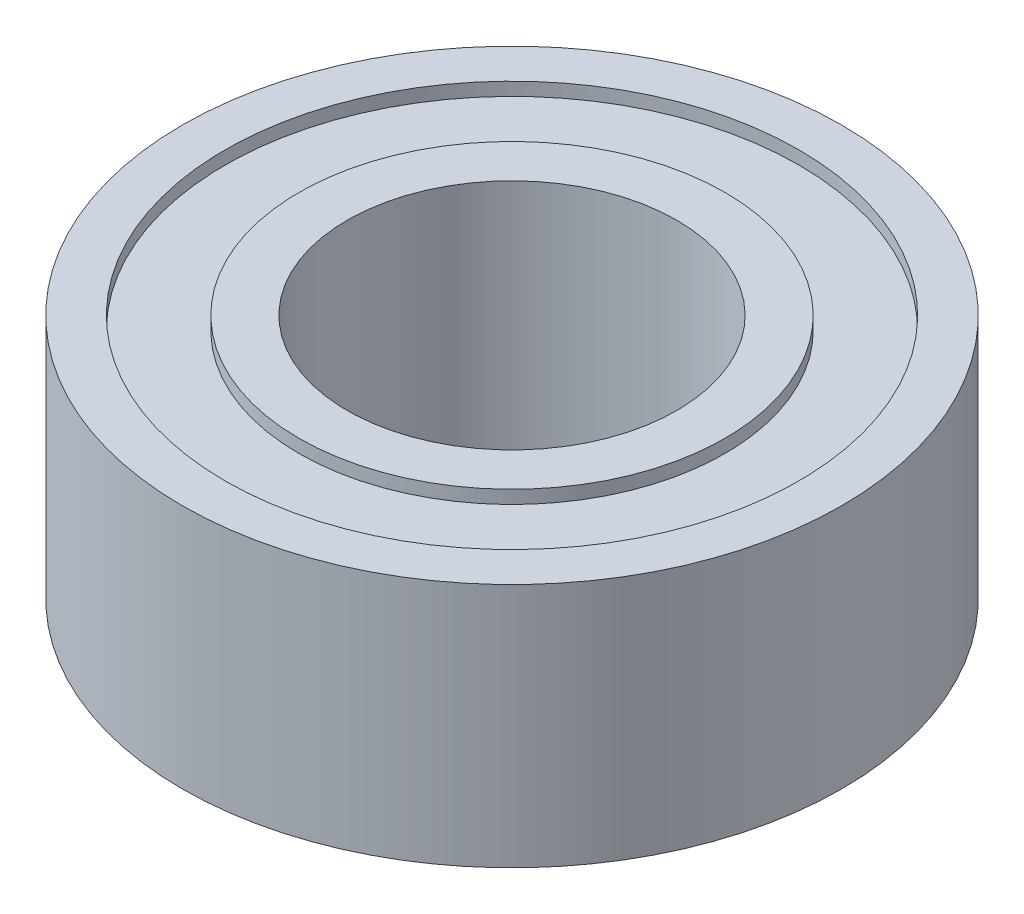
ISO-10303-21;
HEADER;
FILE_DESCRIPTION(('STEP AP214'),'2;1');
FILE_NAME('part.step','',(''),(''),'','','');
FILE_SCHEMA(('AUTOMOTIVE_DESIGN { 1 0 10303 214 1 1 1 1 }'));
ENDSEC;
DATA;
#1=APPLICATION_CONTEXT('core data for automotive mechanical design processes');
#2=APPLICATION_PROTOCOL_DEFINITION('international standard','automotive_design',2000,#1);
#3=PRODUCT_CONTEXT('',#1,'mechanical');
#4=PRODUCT('Part','Part','',(#3));
#5=PRODUCT_RELATED_PRODUCT_CATEGORY('part','',(#4));
#6=PRODUCT_DEFINITION_FORMATION('','',#4);
#7=PRODUCT_DEFINITION_CONTEXT('part definition',#1,'design');
#8=PRODUCT_DEFINITION('design','',#6,#7);
#9=PRODUCT_DEFINITION_SHAPE('','',#8);
#10=(LENGTH_UNIT() NAMED_UNIT(*) SI_UNIT(.MILLI.,.METRE.));
#11=(NAMED_UNIT(*) PLANE_ANGLE_UNIT() SI_UNIT($,.RADIAN.));
#12=(NAMED_UNIT(*) SI_UNIT($,.STERADIAN.) SOLID_ANGLE_UNIT());
#13=UNCERTAINTY_MEASURE_WITH_UNIT(LENGTH_MEASURE(1.E-05),#10,'distance_accuracy_value','');
#14=(GEOMETRIC_REPRESENTATION_CONTEXT(3) GLOBAL_UNCERTAINTY_ASSIGNED_CONTEXT((#13)) GLOBAL_UNIT_ASSIGNED_CONTEXT((#10,
#11,#12)) REPRESENTATION_CONTEXT('',''));
#15=CARTESIAN_POINT('',(0.,0.,0.));
#16=DIRECTION('',(0.,0.,1.));
#17=DIRECTION('',(1.,0.,0.));
#18=AXIS2_PLACEMENT_3D('',#15,#16,#17);
#19=CARTESIAN_POINT('',(0.,4.7244,0.));
#20=DIRECTION('',(0.,-1.,0.));
#21=DIRECTION('',(0.,0.,-1.));
#22=AXIS2_PLACEMENT_3D('',#19,#20,#21);
#23=CYLINDRICAL_SURFACE('',#22,4.1021);
#24=CARTESIAN_POINT('',(0.,4.7244,0.));
#25=DIRECTION('',(0.,-1.,0.));
#26=DIRECTION('',(0.,0.,-1.));
#27=AXIS2_PLACEMENT_3D('',#24,#25,#26);
#28=CIRCLE('',#27,4.1021);
#29=CARTESIAN_POINT('',(0.,4.7244,-4.1021));
#30=VERTEX_POINT('',#29);
#31=EDGE_CURVE('E10',#30,#30,#28,.T.);
#32=ORIENTED_EDGE('',*,*,#31,.T.);
#33=EDGE_LOOP('',(#32));
#34=FACE_BOUND('',#33,.T.);
#35=CARTESIAN_POINT('',(0.,4.4704,0.));
#36=DIRECTION('',(0.,-1.,0.));
#37=DIRECTION('',(0.,0.,-1.));
#38=AXIS2_PLACEMENT_3D('',#35,#36,#37);
#39=CIRCLE('',#38,4.1021);
#40=CARTESIAN_POINT('',(0.,4.4704,-4.1021));
#41=VERTEX_POINT('',#40);
#42=EDGE_CURVE('E71',#41,#41,#39,.T.);
#43=ORIENTED_EDGE('',*,*,#42,.F.);
#44=EDGE_LOOP('',(#43));
#45=FACE_BOUND('',#44,.T.);
#46=ADVANCED_FACE('F31',(#34,#45),#23,.T.);
#47=CARTESIAN_POINT('',(4.1021,4.7244,0.));
#48=DIRECTION('',(0.,1.,0.));
#49=DIRECTION('',(0.,0.,1.));
#50=AXIS2_PLACEMENT_3D('',#47,#48,#49);
#51=PLANE('',#50);
#52=CARTESIAN_POINT('',(0.,4.7244,0.));
#53=DIRECTION('',(0.,-1.,0.));
#54=DIRECTION('',(0.,0.,-1.));
#55=AXIS2_PLACEMENT_3D('',#52,#53,#54);
#56=CIRCLE('',#55,3.175);
#57=CARTESIAN_POINT('',(0.,4.7244,-3.175));
#58=VERTEX_POINT('',#57);
#59=EDGE_CURVE('E37',#58,#58,#56,.T.);
#60=ORIENTED_EDGE('',*,*,#59,.T.);
#61=EDGE_LOOP('',(#60));
#62=FACE_BOUND('',#61,.T.);
#63=ORIENTED_EDGE('',*,*,#31,.F.);
#64=EDGE_LOOP('',(#63));
#65=FACE_BOUND('',#64,.T.);
#66=ADVANCED_FACE('F79',(#62,#65),#51,.T.);
#67=CARTESIAN_POINT('',(0.,4.7244,0.));
#68=DIRECTION('',(0.,-1.,0.));
#69=DIRECTION('',(0.,0.,-1.));
#70=AXIS2_PLACEMENT_3D('',#67,#68,#69);
#71=CYLINDRICAL_SURFACE('',#70,3.175);
#72=CARTESIAN_POINT('',(0.,0.,0.));
#73=DIRECTION('',(0.,-1.,0.));
#74=DIRECTION('',(0.,0.,-1.));
#75=AXIS2_PLACEMENT_3D('',#72,#73,#74);
#76=CIRCLE('',#75,3.175);
#77=CARTESIAN_POINT('',(0.,0.,-3.175));
#78=VERTEX_POINT('',#77);
#79=EDGE_CURVE('E41',#78,#78,#76,.T.);
#80=ORIENTED_EDGE('',*,*,#79,.T.);
#81=EDGE_LOOP('',(#80));
#82=FACE_BOUND('',#81,.T.);
#83=ORIENTED_EDGE('',*,*,#59,.F.);
#84=EDGE_LOOP('',(#83));
#85=FACE_BOUND('',#84,.T.);
#86=ADVANCED_FACE('F83',(#82,#85),#71,.F.);
#87=CARTESIAN_POINT('',(3.175,0.,0.));
#88=DIRECTION('',(0.,-1.,0.));
#89=DIRECTION('',(0.,0.,-1.));
#90=AXIS2_PLACEMENT_3D('',#87,#88,#89);
#91=PLANE('',#90);
#92=CARTESIAN_POINT('',(0.,0.,0.));
#93=DIRECTION('',(0.,-1.,0.));
#94=DIRECTION('',(0.,0.,-1.));
#95=AXIS2_PLACEMENT_3D('',#92,#93,#94);
#96=CIRCLE('',#95,4.1021);
#97=CARTESIAN_POINT('',(0.,0.,-4.1021));
#98=VERTEX_POINT('',#97);
#99=EDGE_CURVE('E45',#98,#98,#96,.T.);
#100=ORIENTED_EDGE('',*,*,#99,.T.);
#101=EDGE_LOOP('',(#100));
#102=FACE_BOUND('',#101,.T.);
#103=ORIENTED_EDGE('',*,*,#79,.F.);
#104=EDGE_LOOP('',(#103));
#105=FACE_BOUND('',#104,.T.);
#106=ADVANCED_FACE('F87',(#102,#105),#91,.T.);
#107=CARTESIAN_POINT('',(0.,4.7244,0.));
#108=DIRECTION('',(0.,-1.,0.));
#109=DIRECTION('',(0.,0.,-1.));
#110=AXIS2_PLACEMENT_3D('',#107,#108,#109);
#111=CYLINDRICAL_SURFACE('',#110,4.1021);
#112=CARTESIAN_POINT('',(0.,0.254,0.));
#113=DIRECTION('',(0.,-1.,0.));
#114=DIRECTION('',(0.,0.,-1.));
#115=AXIS2_PLACEMENT_3D('',#112,#113,#114);
#116=CIRCLE('',#115,4.1021);
#117=CARTESIAN_POINT('',(0.,0.254,-4.1021));
#118=VERTEX_POINT('',#117);
#119=EDGE_CURVE('E50',#118,#118,#116,.T.);
#120=ORIENTED_EDGE('',*,*,#119,.T.);
#121=EDGE_LOOP('',(#120));
#122=FACE_BOUND('',#121,.T.);
#123=ORIENTED_EDGE('',*,*,#99,.F.);
#124=EDGE_LOOP('',(#123));
#125=FACE_BOUND('',#124,.T.);
#126=ADVANCED_FACE('F94',(#122,#125),#111,.T.);
#127=CARTESIAN_POINT('',(4.1021,0.254,0.));
#128=DIRECTION('',(0.,-1.,0.));
#129=DIRECTION('',(0.,0.,-1.));
#130=AXIS2_PLACEMENT_3D('',#127,#128,#129);
#131=PLANE('',#130);
#132=CARTESIAN_POINT('',(0.,0.254,0.));
#133=DIRECTION('',(0.,-1.,0.));
#134=DIRECTION('',(0.,0.,-1.));
#135=AXIS2_PLACEMENT_3D('',#132,#133,#134);
#136=CIRCLE('',#135,5.5245);
#137=CARTESIAN_POINT('',(0.,0.254,-5.5245));
#138=VERTEX_POINT('',#137);
#139=EDGE_CURVE('E53',#138,#138,#136,.T.);
#140=ORIENTED_EDGE('',*,*,#139,.T.);
#141=EDGE_LOOP('',(#140));
#142=FACE_BOUND('',#141,.T.);
#143=ORIENTED_EDGE('',*,*,#119,.F.);
#144=EDGE_LOOP('',(#143));
#145=FACE_BOUND('',#144,.T.);
#146=ADVANCED_FACE('F98',(#142,#145),#131,.T.);
#147=CARTESIAN_POINT('',(0.,4.7244,0.));
#148=DIRECTION('',(0.,-1.,0.));
#149=DIRECTION('',(0.,0.,-1.));
#150=AXIS2_PLACEMENT_3D('',#147,#148,#149);
#151=CYLINDRICAL_SURFACE('',#150,5.5245);
#152=CARTESIAN_POINT('',(0.,0.,0.));
#153=DIRECTION('',(0.,-1.,0.));
#154=DIRECTION('',(0.,0.,-1.));
#155=AXIS2_PLACEMENT_3D('',#152,#153,#154);
#156=CIRCLE('',#155,5.5245);
#157=CARTESIAN_POINT('',(0.,0.,-5.5245));
#158=VERTEX_POINT('',#157);
#159=EDGE_CURVE('E56',#158,#158,#156,.T.);
#160=ORIENTED_EDGE('',*,*,#159,.T.);
#161=EDGE_LOOP('',(#160));
#162=FACE_BOUND('',#161,.T.);
#163=ORIENTED_EDGE('',*,*,#139,.F.);
#164=EDGE_LOOP('',(#163));
#165=FACE_BOUND('',#164,.T.);
#166=ADVANCED_FACE('F102',(#162,#165),#151,.F.);
#167=CARTESIAN_POINT('',(5.5245,0.,0.));
#168=DIRECTION('',(0.,-1.,0.));
#169=DIRECTION('',(0.,0.,-1.));
#170=AXIS2_PLACEMENT_3D('',#167,#168,#169);
#171=PLANE('',#170);
#172=CARTESIAN_POINT('',(0.,0.,0.));
#173=DIRECTION('',(0.,-1.,0.));
#174=DIRECTION('',(0.,0.,-1.));
#175=AXIS2_PLACEMENT_3D('',#172,#173,#174);
#176=CIRCLE('',#175,6.35);
#177=CARTESIAN_POINT('',(0.,0.,-6.35));
#178=VERTEX_POINT('',#177);
#179=EDGE_CURVE('E59',#178,#178,#176,.T.);
#180=ORIENTED_EDGE('',*,*,#179,.T.);
#181=EDGE_LOOP('',(#180));
#182=FACE_BOUND('',#181,.T.);
#183=ORIENTED_EDGE('',*,*,#159,.F.);
#184=EDGE_LOOP('',(#183));
#185=FACE_BOUND('',#184,.T.);
#186=ADVANCED_FACE('F106',(#182,#185),#171,.T.);
#187=CARTESIAN_POINT('',(0.,4.7244,0.));
#188=DIRECTION('',(0.,-1.,0.));
#189=DIRECTION('',(0.,0.,-1.));
#190=AXIS2_PLACEMENT_3D('',#187,#188,#189);
#191=CYLINDRICAL_SURFACE('',#190,6.35);
#192=CARTESIAN_POINT('',(0.,4.7244,0.));
#193=DIRECTION('',(0.,-1.,0.));
#194=DIRECTION('',(0.,0.,-1.));
#195=AXIS2_PLACEMENT_3D('',#192,#193,#194);
#196=CIRCLE('',#195,6.35);
#197=CARTESIAN_POINT('',(0.,4.7244,-6.35));
#198=VERTEX_POINT('',#197);
#199=EDGE_CURVE('E62',#198,#198,#196,.T.);
#200=ORIENTED_EDGE('',*,*,#199,.T.);
#201=EDGE_LOOP('',(#200));
#202=FACE_BOUND('',#201,.T.);
#203=ORIENTED_EDGE('',*,*,#179,.F.);
#204=EDGE_LOOP('',(#203));
#205=FACE_BOUND('',#204,.T.);
#206=ADVANCED_FACE('F110',(#202,#205),#191,.T.);
#207=CARTESIAN_POINT('',(6.35,4.7244,0.));
#208=DIRECTION('',(0.,1.,0.));
#209=DIRECTION('',(0.,0.,1.));
#210=AXIS2_PLACEMENT_3D('',#207,#208,#209);
#211=PLANE('',#210);
#212=CARTESIAN_POINT('',(0.,4.7244,0.));
#213=DIRECTION('',(0.,-1.,0.));
#214=DIRECTION('',(0.,0.,-1.));
#215=AXIS2_PLACEMENT_3D('',#212,#213,#214);
#216=CIRCLE('',#215,5.5245);
#217=CARTESIAN_POINT('',(0.,4.7244,-5.5245));
#218=VERTEX_POINT('',#217);
#219=EDGE_CURVE('E65',#218,#218,#216,.T.);
#220=ORIENTED_EDGE('',*,*,#219,.T.);
#221=EDGE_LOOP('',(#220));
#222=FACE_BOUND('',#221,.T.);
#223=ORIENTED_EDGE('',*,*,#199,.F.);
#224=EDGE_LOOP('',(#223));
#225=FACE_BOUND('',#224,.T.);
#226=ADVANCED_FACE('F114',(#222,#225),#211,.T.);
#227=CARTESIAN_POINT('',(0.,4.7244,0.));
#228=DIRECTION('',(0.,-1.,0.));
#229=DIRECTION('',(0.,0.,-1.));
#230=AXIS2_PLACEMENT_3D('',#227,#228,#229);
#231=CYLINDRICAL_SURFACE('',#230,5.5245);
#232=CARTESIAN_POINT('',(0.,4.4704,0.));
#233=DIRECTION('',(0.,-1.,0.));
#234=DIRECTION('',(0.,0.,-1.));
#235=AXIS2_PLACEMENT_3D('',#232,#233,#234);
#236=CIRCLE('',#235,5.5245);
#237=CARTESIAN_POINT('',(0.,4.4704,-5.5245));
#238=VERTEX_POINT('',#237);
#239=EDGE_CURVE('E68',#238,#238,#236,.T.);
#240=ORIENTED_EDGE('',*,*,#239,.T.);
#241=EDGE_LOOP('',(#240));
#242=FACE_BOUND('',#241,.T.);
#243=ORIENTED_EDGE('',*,*,#219,.F.);
#244=EDGE_LOOP('',(#243));
#245=FACE_BOUND('',#244,.T.);
#246=ADVANCED_FACE('F118',(#242,#245),#231,.F.);
#247=CARTESIAN_POINT('',(5.5245,4.4704,0.));
#248=DIRECTION('',(0.,1.,0.));
#249=DIRECTION('',(0.,0.,1.));
#250=AXIS2_PLACEMENT_3D('',#247,#248,#249);
#251=PLANE('',#250);
#252=ORIENTED_EDGE('',*,*,#42,.T.);
#253=EDGE_LOOP('',(#252));
#254=FACE_BOUND('',#253,.T.);
#255=ORIENTED_EDGE('',*,*,#239,.F.);
#256=EDGE_LOOP('',(#255));
#257=FACE_BOUND('',#256,.T.);
#258=ADVANCED_FACE('F75',(#254,#257),#251,.T.);
#259=CLOSED_SHELL('',(#46,#66,#86,#106,#126,#146,#166,#186,#206,#226,#246,#258));
#260=MANIFOLD_SOLID_BREP('B2',#259);
#261=ADVANCED_BREP_SHAPE_REPRESENTATION('',(#18,#260),#14);
#262=SHAPE_DEFINITION_REPRESENTATION(#9,#261);
ENDSEC;
END-ISO-10303-21;
